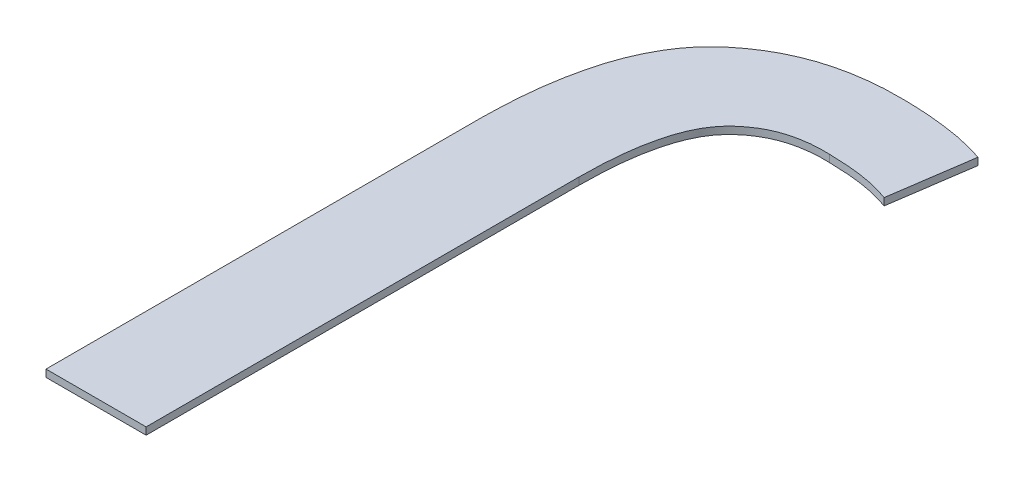
ISO-10303-21;
HEADER;
FILE_DESCRIPTION(('STEP AP214'),'2;1');
FILE_NAME('part.step','',(''),(''),'','','');
FILE_SCHEMA(('AUTOMOTIVE_DESIGN { 1 0 10303 214 1 1 1 1 }'));
ENDSEC;
DATA;
#1=APPLICATION_CONTEXT('core data for automotive mechanical design processes');
#2=APPLICATION_PROTOCOL_DEFINITION('international standard','automotive_design',2000,#1);
#3=PRODUCT_CONTEXT('',#1,'mechanical');
#4=PRODUCT('Part','Part','',(#3));
#5=PRODUCT_RELATED_PRODUCT_CATEGORY('part','',(#4));
#6=PRODUCT_DEFINITION_FORMATION('','',#4);
#7=PRODUCT_DEFINITION_CONTEXT('part definition',#1,'design');
#8=PRODUCT_DEFINITION('design','',#6,#7);
#9=PRODUCT_DEFINITION_SHAPE('','',#8);
#10=(LENGTH_UNIT() NAMED_UNIT(*) SI_UNIT(.MILLI.,.METRE.));
#11=(NAMED_UNIT(*) PLANE_ANGLE_UNIT() SI_UNIT($,.RADIAN.));
#12=(NAMED_UNIT(*) SI_UNIT($,.STERADIAN.) SOLID_ANGLE_UNIT());
#13=UNCERTAINTY_MEASURE_WITH_UNIT(LENGTH_MEASURE(1.E-05),#10,'distance_accuracy_value','');
#14=(GEOMETRIC_REPRESENTATION_CONTEXT(3) GLOBAL_UNCERTAINTY_ASSIGNED_CONTEXT((#13)) GLOBAL_UNIT_ASSIGNED_CONTEXT((#10,
#11,#12)) REPRESENTATION_CONTEXT('',''));
#15=CARTESIAN_POINT('',(0.,0.,0.));
#16=DIRECTION('',(0.,0.,1.));
#17=DIRECTION('',(1.,0.,0.));
#18=AXIS2_PLACEMENT_3D('',#15,#16,#17);
#19=CARTESIAN_POINT('',(-0.552273294096341,0.006,-0.15386547758367));
#20=DIRECTION('',(1.,0.,0.));
#21=DIRECTION('',(0.,0.,-1.));
#22=AXIS2_PLACEMENT_3D('',#19,#20,#21);
#23=PLANE('',#22);
#24=DIRECTION('',(0.,0.,1.));
#25=VECTOR('',#24,1.);
#26=CARTESIAN_POINT('',(-0.552273294096341,0.,-0.15386547758367));
#27=LINE('',#26,#25);
#28=CARTESIAN_POINT('',(-0.552273294096341,0.,-0.153865477583671));
#29=VERTEX_POINT('',#28);
#30=CARTESIAN_POINT('',(-0.552273294096341,0.,0.207212096222748));
#31=VERTEX_POINT('',#30);
#32=EDGE_CURVE('E210',#29,#31,#27,.T.);
#33=ORIENTED_EDGE('',*,*,#32,.T.);
#34=DIRECTION('',(0.,-1.,0.));
#35=VECTOR('',#34,1.);
#36=CARTESIAN_POINT('',(-0.552273294096341,0.006,0.207212096222748));
#37=LINE('',#36,#35);
#38=CARTESIAN_POINT('',(-0.552273294096341,0.006,0.207212096222748));
#39=VERTEX_POINT('',#38);
#40=EDGE_CURVE('E11',#39,#31,#37,.T.);
#41=ORIENTED_EDGE('',*,*,#40,.F.);
#42=DIRECTION('',(0.,0.,1.));
#43=VECTOR('',#42,1.);
#44=CARTESIAN_POINT('',(-0.552273294096341,0.006,-0.15386547758367));
#45=LINE('',#44,#43);
#46=CARTESIAN_POINT('',(-0.552273294096341,0.006,-0.153865477583671));
#47=VERTEX_POINT('',#46);
#48=EDGE_CURVE('E171',#47,#39,#45,.T.);
#49=ORIENTED_EDGE('',*,*,#48,.F.);
#50=DIRECTION('',(0.,-1.,0.));
#51=VECTOR('',#50,1.);
#52=CARTESIAN_POINT('',(-0.552273294096341,0.006,-0.153865477583671));
#53=LINE('',#52,#51);
#54=EDGE_CURVE('E126',#47,#29,#53,.T.);
#55=ORIENTED_EDGE('',*,*,#54,.T.);
#56=EDGE_LOOP('',(#33,#41,#49,#55));
#57=FACE_BOUND('',#56,.T.);
#58=ADVANCED_FACE('F34',(#57),#23,.F.);
#59=CARTESIAN_POINT('',(-0.552273294096341,0.006,0.207212096222748));
#60=DIRECTION('',(0.,0.,-1.));
#61=DIRECTION('',(-1.,0.,0.));
#62=AXIS2_PLACEMENT_3D('',#59,#60,#61);
#63=PLANE('',#62);
#64=DIRECTION('',(1.,0.,0.));
#65=VECTOR('',#64,1.);
#66=CARTESIAN_POINT('',(-0.552273294096341,0.,0.207212096222748));
#67=LINE('',#66,#65);
#68=CARTESIAN_POINT('',(-0.469416036299848,0.,0.207212096222748));
#69=VERTEX_POINT('',#68);
#70=EDGE_CURVE('E204',#31,#69,#67,.T.);
#71=ORIENTED_EDGE('',*,*,#70,.T.);
#72=DIRECTION('',(0.,-1.,0.));
#73=VECTOR('',#72,1.);
#74=CARTESIAN_POINT('',(-0.469416036299848,0.006,0.207212096222748));
#75=LINE('',#74,#73);
#76=CARTESIAN_POINT('',(-0.469416036299848,0.006,0.207212096222748));
#77=VERTEX_POINT('',#76);
#78=EDGE_CURVE('E42',#77,#69,#75,.T.);
#79=ORIENTED_EDGE('',*,*,#78,.F.);
#80=DIRECTION('',(1.,0.,0.));
#81=VECTOR('',#80,1.);
#82=CARTESIAN_POINT('',(-0.552273294096341,0.006,0.207212096222748));
#83=LINE('',#82,#81);
#84=EDGE_CURVE('E93',#39,#77,#83,.T.);
#85=ORIENTED_EDGE('',*,*,#84,.F.);
#86=ORIENTED_EDGE('',*,*,#40,.T.);
#87=EDGE_LOOP('',(#71,#79,#85,#86));
#88=FACE_BOUND('',#87,.T.);
#89=ADVANCED_FACE('F232',(#88),#63,.F.);
#90=CARTESIAN_POINT('',(-0.469416036299848,0.006,0.207212096222748));
#91=DIRECTION('',(-1.,0.,0.));
#92=DIRECTION('',(0.,0.,1.));
#93=AXIS2_PLACEMENT_3D('',#90,#91,#92);
#94=PLANE('',#93);
#95=DIRECTION('',(0.,0.,-1.));
#96=VECTOR('',#95,1.);
#97=CARTESIAN_POINT('',(-0.469416036299848,0.,0.207212096222748));
#98=LINE('',#97,#96);
#99=CARTESIAN_POINT('',(-0.469416036299848,0.,-0.151089149743533));
#100=VERTEX_POINT('',#99);
#101=EDGE_CURVE('E199',#69,#100,#98,.T.);
#102=ORIENTED_EDGE('',*,*,#101,.T.);
#103=DIRECTION('',(0.,-1.,0.));
#104=VECTOR('',#103,1.);
#105=CARTESIAN_POINT('',(-0.469416036299848,0.006,-0.151089149743533));
#106=LINE('',#105,#104);
#107=CARTESIAN_POINT('',(-0.469416036299848,0.006,-0.151089149743533));
#108=VERTEX_POINT('',#107);
#109=EDGE_CURVE('E191',#108,#100,#106,.T.);
#110=ORIENTED_EDGE('',*,*,#109,.F.);
#111=DIRECTION('',(0.,0.,-1.));
#112=VECTOR('',#111,1.);
#113=CARTESIAN_POINT('',(-0.469416036299848,0.006,0.207212096222748));
#114=LINE('',#113,#112);
#115=EDGE_CURVE('E165',#77,#108,#114,.T.);
#116=ORIENTED_EDGE('',*,*,#115,.F.);
#117=ORIENTED_EDGE('',*,*,#78,.T.);
#118=EDGE_LOOP('',(#102,#110,#116,#117));
#119=FACE_BOUND('',#118,.T.);
#120=ADVANCED_FACE('F197',(#119),#94,.F.);
#121=CARTESIAN_POINT('',(-0.469416036299848,0.006,-0.151089149743533));
#122=CARTESIAN_POINT('',(-0.469337668432445,0.006,-0.156710764659553));
#123=CARTESIAN_POINT('',(-0.469187030640725,0.006,-0.167516566640904));
#124=CARTESIAN_POINT('',(-0.468051362626175,0.006,-0.183019987168691));
#125=CARTESIAN_POINT('',(-0.46630936957585,0.006,-0.197186891604784));
#126=CARTESIAN_POINT('',(-0.46360819117192,0.006,-0.209875156332515));
#127=CARTESIAN_POINT('',(-0.460547741454844,0.006,-0.221272507539462));
#128=CARTESIAN_POINT('',(-0.456571693490011,0.006,-0.231201279501752));
#129=CARTESIAN_POINT('',(-0.4519142955133,0.006,-0.239795102661912));
#130=CARTESIAN_POINT('',(-0.446397888397714,0.006,-0.246954711664905));
#131=CARTESIAN_POINT('',(-0.440258106819841,0.006,-0.252955311430089));
#132=CARTESIAN_POINT('',(-0.433597543655136,0.006,-0.258071325340383));
#133=CARTESIAN_POINT('',(-0.42638388990424,0.006,-0.26240557805737));
#134=CARTESIAN_POINT('',(-0.418587315050106,0.006,-0.265910912685989));
#135=CARTESIAN_POINT('',(-0.410168879270515,0.006,-0.268420499203571));
#136=CARTESIAN_POINT('',(-0.401249065221441,0.006,-0.270140745251749));
#137=CARTESIAN_POINT('',(-0.391783880229694,0.006,-0.271114739904381));
#138=CARTESIAN_POINT('',(-0.385302472670253,0.006,-0.270977129714614));
#139=CARTESIAN_POINT('',(-0.381967140219809,0.006,-0.270906315508405));
#140=B_SPLINE_CURVE_WITH_KNOTS('',3,(#121,#122,#123,#124,#125,#126,#127,#128,#129,#130,#131,
#132,#133,#134,#135,#136,#137,#138,#139),.UNSPECIFIED.,.F.,.F.,(4,1,1,1,1,1,1,1,1,1,1,1,1,1,1,1,
4),(0.,0.0983860291996174,0.189116466557098,0.27197123945058,0.347983258187652,
0.416023109793835,0.478265351250489,0.534761260369765,0.586560463987548,0.635816773464451,
0.684639416603328,0.733240129219385,0.782808474359632,0.833845959526921,0.886621313547149,
0.941655325846,1.),.UNSPECIFIED.);
#141=DIRECTION('',(0.,-1.,0.));
#142=VECTOR('',#141,1.);
#143=SURFACE_OF_LINEAR_EXTRUSION('',#140,#142);
#144=CARTESIAN_POINT('',(-0.469416036299848,0.,-0.151089149743533));
#145=CARTESIAN_POINT('',(-0.469337668432445,0.,-0.156710764659553));
#146=CARTESIAN_POINT('',(-0.469187030640725,0.,-0.167516566640904));
#147=CARTESIAN_POINT('',(-0.468051362626175,0.,-0.183019987168691));
#148=CARTESIAN_POINT('',(-0.46630936957585,0.,-0.197186891604784));
#149=CARTESIAN_POINT('',(-0.46360819117192,0.,-0.209875156332515));
#150=CARTESIAN_POINT('',(-0.460547741454844,0.,-0.221272507539462));
#151=CARTESIAN_POINT('',(-0.456571693490011,0.,-0.231201279501752));
#152=CARTESIAN_POINT('',(-0.4519142955133,0.,-0.239795102661912));
#153=CARTESIAN_POINT('',(-0.446397888397714,0.,-0.246954711664905));
#154=CARTESIAN_POINT('',(-0.440258106819841,0.,-0.252955311430089));
#155=CARTESIAN_POINT('',(-0.433597543655136,0.,-0.258071325340383));
#156=CARTESIAN_POINT('',(-0.42638388990424,0.,-0.26240557805737));
#157=CARTESIAN_POINT('',(-0.418587315050106,0.,-0.265910912685989));
#158=CARTESIAN_POINT('',(-0.410168879270515,0.,-0.268420499203571));
#159=CARTESIAN_POINT('',(-0.401249065221441,0.,-0.270140745251749));
#160=CARTESIAN_POINT('',(-0.391783880229694,0.,-0.271114739904381));
#161=CARTESIAN_POINT('',(-0.385302472670253,0.,-0.270977129714614));
#162=CARTESIAN_POINT('',(-0.381967140219809,0.,-0.270906315508405));
#163=B_SPLINE_CURVE_WITH_KNOTS('',3,(#144,#145,#146,#147,#148,#149,#150,#151,#152,#153,#154,
#155,#156,#157,#158,#159,#160,#161,#162),.UNSPECIFIED.,.F.,.F.,(4,1,1,1,1,1,1,1,1,1,1,1,1,1,1,1,
4),(0.,0.0983860291996174,0.189116466557098,0.27197123945058,0.347983258187652,
0.416023109793835,0.478265351250489,0.534761260369765,0.586560463987548,0.635816773464451,
0.684639416603328,0.733240129219385,0.782808474359632,0.833845959526921,0.886621313547149,
0.941655325846,1.),.UNSPECIFIED.);
#164=CARTESIAN_POINT('',(-0.381967140219809,0.,-0.270906315508405));
#165=VERTEX_POINT('',#164);
#166=EDGE_CURVE('E206',#100,#165,#163,.T.);
#167=ORIENTED_EDGE('',*,*,#166,.T.);
#168=DIRECTION('',(0.,-1.,0.));
#169=VECTOR('',#168,1.);
#170=CARTESIAN_POINT('',(-0.381967140219809,0.006,-0.270906315508405));
#171=LINE('',#170,#169);
#172=CARTESIAN_POINT('',(-0.381967140219809,0.006,-0.270906315508405));
#173=VERTEX_POINT('',#172);
#174=EDGE_CURVE('E188',#173,#165,#171,.T.);
#175=ORIENTED_EDGE('',*,*,#174,.F.);
#176=EDGE_CURVE('E157',#108,#173,#140,.T.);
#177=ORIENTED_EDGE('',*,*,#176,.F.);
#178=ORIENTED_EDGE('',*,*,#109,.T.);
#179=EDGE_LOOP('',(#167,#175,#177,#178));
#180=FACE_BOUND('',#179,.T.);
#181=ADVANCED_FACE('F150',(#180),#143,.F.);
#182=CARTESIAN_POINT('',(-0.381967140219809,0.006,-0.270906315508405));
#183=CARTESIAN_POINT('',(-0.376724266556487,0.006,-0.270742629079489));
#184=CARTESIAN_POINT('',(-0.366722854761358,0.006,-0.270430377538448));
#185=CARTESIAN_POINT('',(-0.352487182291243,0.006,-0.268821302449865));
#186=CARTESIAN_POINT('',(-0.339787948115716,0.006,-0.266275373822243));
#187=CARTESIAN_POINT('',(-0.332048262192236,0.006,-0.26366760199365));
#188=CARTESIAN_POINT('',(-0.328395701762542,0.006,-0.262436926190399));
#189=B_SPLINE_CURVE_WITH_KNOTS('',3,(#182,#183,#184,#185,#186,#187,#188),.UNSPECIFIED.,.F.,.F.,
(4,1,1,1,4),(0.,0.288687948249944,0.550706966474674,0.787966853976176,1.),.UNSPECIFIED.);
#190=DIRECTION('',(0.,-1.,0.));
#191=VECTOR('',#190,1.);
#192=SURFACE_OF_LINEAR_EXTRUSION('',#189,#191);
#193=CARTESIAN_POINT('',(-0.381967140219809,0.,-0.270906315508405));
#194=CARTESIAN_POINT('',(-0.376724266556487,0.,-0.270742629079489));
#195=CARTESIAN_POINT('',(-0.366722854761358,0.,-0.270430377538448));
#196=CARTESIAN_POINT('',(-0.352487182291243,0.,-0.268821302449865));
#197=CARTESIAN_POINT('',(-0.339787948115716,0.,-0.266275373822243));
#198=CARTESIAN_POINT('',(-0.332048262192236,0.,-0.26366760199365));
#199=CARTESIAN_POINT('',(-0.328395701762542,0.,-0.262436926190399));
#200=B_SPLINE_CURVE_WITH_KNOTS('',3,(#193,#194,#195,#196,#197,#198,#199),.UNSPECIFIED.,.F.,.F.,
(4,1,1,1,4),(0.,0.288687948249944,0.550706966474674,0.787966853976176,1.),.UNSPECIFIED.);
#201=CARTESIAN_POINT('',(-0.328395701762542,0.,-0.262436926190399));
#202=VERTEX_POINT('',#201);
#203=EDGE_CURVE('E208',#165,#202,#200,.T.);
#204=ORIENTED_EDGE('',*,*,#203,.T.);
#205=DIRECTION('',(0.,-1.,0.));
#206=VECTOR('',#205,1.);
#207=CARTESIAN_POINT('',(-0.328395701762542,0.006,-0.262436926190399));
#208=LINE('',#207,#206);
#209=CARTESIAN_POINT('',(-0.328395701762542,0.006,-0.262436926190399));
#210=VERTEX_POINT('',#209);
#211=EDGE_CURVE('E121',#210,#202,#208,.T.);
#212=ORIENTED_EDGE('',*,*,#211,.F.);
#213=EDGE_CURVE('E112',#173,#210,#189,.T.);
#214=ORIENTED_EDGE('',*,*,#213,.F.);
#215=ORIENTED_EDGE('',*,*,#174,.T.);
#216=EDGE_LOOP('',(#204,#212,#214,#215));
#217=FACE_BOUND('',#216,.T.);
#218=ADVANCED_FACE('F147',(#217),#192,.F.);
#219=CARTESIAN_POINT('',(-0.328395701762542,0.006,-0.262436926190399));
#220=DIRECTION('',(-0.989471047348127,0.,-0.144730945066353));
#221=DIRECTION('',(-0.144730945066353,0.,0.989471047348128));
#222=AXIS2_PLACEMENT_3D('',#219,#220,#221);
#223=PLANE('',#222);
#224=DIRECTION('',(0.144730945066353,0.,-0.989471047348127));
#225=VECTOR('',#224,1.);
#226=CARTESIAN_POINT('',(-0.328395701762542,0.,-0.262436926190399));
#227=LINE('',#226,#225);
#228=CARTESIAN_POINT('',(-0.318478109849485,0.,-0.330239772726674));
#229=VERTEX_POINT('',#228);
#230=EDGE_CURVE('E120',#202,#229,#227,.T.);
#231=ORIENTED_EDGE('',*,*,#230,.T.);
#232=DIRECTION('',(0.,-1.,0.));
#233=VECTOR('',#232,1.);
#234=CARTESIAN_POINT('',(-0.318478109849485,0.006,-0.330239772726674));
#235=LINE('',#234,#233);
#236=CARTESIAN_POINT('',(-0.318478109849485,0.006,-0.330239772726674));
#237=VERTEX_POINT('',#236);
#238=EDGE_CURVE('E117',#237,#229,#235,.T.);
#239=ORIENTED_EDGE('',*,*,#238,.F.);
#240=DIRECTION('',(0.144730945066353,0.,-0.989471047348127));
#241=VECTOR('',#240,1.);
#242=CARTESIAN_POINT('',(-0.328395701762542,0.006,-0.262436926190399));
#243=LINE('',#242,#241);
#244=EDGE_CURVE('E106',#210,#237,#243,.T.);
#245=ORIENTED_EDGE('',*,*,#244,.F.);
#246=ORIENTED_EDGE('',*,*,#211,.T.);
#247=EDGE_LOOP('',(#231,#239,#245,#246));
#248=FACE_BOUND('',#247,.T.);
#249=ADVANCED_FACE('F118',(#248),#223,.F.);
#250=CARTESIAN_POINT('',(-0.318478109849485,0.006,-0.330239772726674));
#251=CARTESIAN_POINT('',(-0.320825797884387,0.006,-0.330991558053056));
#252=CARTESIAN_POINT('',(-0.325688200483862,0.006,-0.332548614557542));
#253=CARTESIAN_POINT('',(-0.333418865952208,0.006,-0.334595902767406));
#254=CARTESIAN_POINT('',(-0.341857287550663,0.006,-0.336433720997437));
#255=CARTESIAN_POINT('',(-0.354125933330945,0.006,-0.338423269029014));
#256=CARTESIAN_POINT('',(-0.369943111911709,0.006,-0.340262821939287));
#257=CARTESIAN_POINT('',(-0.38274369146314,0.006,-0.340624439046402));
#258=CARTESIAN_POINT('',(-0.389109998680778,0.006,-0.340804287590744));
#259=B_SPLINE_CURVE_WITH_KNOTS('',3,(#250,#251,#252,#253,#254,#255,#256,#257,#258),
.UNSPECIFIED.,.F.,.F.,(4,1,1,1,1,1,4),(0.,0.103139195979262,0.213616241673338,0.334495418146242,
0.464358482783334,0.733601244895057,1.),.UNSPECIFIED.);
#260=DIRECTION('',(0.,-1.,0.));
#261=VECTOR('',#260,1.);
#262=SURFACE_OF_LINEAR_EXTRUSION('',#259,#261);
#263=CARTESIAN_POINT('',(-0.318478109849485,0.,-0.330239772726674));
#264=CARTESIAN_POINT('',(-0.320825797884387,0.,-0.330991558053056));
#265=CARTESIAN_POINT('',(-0.325688200483862,0.,-0.332548614557542));
#266=CARTESIAN_POINT('',(-0.333418865952208,0.,-0.334595902767406));
#267=CARTESIAN_POINT('',(-0.341857287550663,0.,-0.336433720997437));
#268=CARTESIAN_POINT('',(-0.354125933330945,0.,-0.338423269029014));
#269=CARTESIAN_POINT('',(-0.369943111911709,0.,-0.340262821939287));
#270=CARTESIAN_POINT('',(-0.38274369146314,0.,-0.340624439046402));
#271=CARTESIAN_POINT('',(-0.389109998680778,0.,-0.340804287590744));
#272=B_SPLINE_CURVE_WITH_KNOTS('',3,(#263,#264,#265,#266,#267,#268,#269,#270,#271),
.UNSPECIFIED.,.F.,.F.,(4,1,1,1,1,1,4),(0.,0.103139195979262,0.213616241673338,0.334495418146242,
0.464358482783334,0.733601244895057,1.),.UNSPECIFIED.);
#273=CARTESIAN_POINT('',(-0.389109998680778,0.,-0.340804287590744));
#274=VERTEX_POINT('',#273);
#275=EDGE_CURVE('E79',#229,#274,#272,.T.);
#276=ORIENTED_EDGE('',*,*,#275,.T.);
#277=DIRECTION('',(0.,-1.,0.));
#278=VECTOR('',#277,1.);
#279=CARTESIAN_POINT('',(-0.389109998680778,0.006,-0.340804287590744));
#280=LINE('',#279,#278);
#281=CARTESIAN_POINT('',(-0.389109998680778,0.006,-0.340804287590744));
#282=VERTEX_POINT('',#281);
#283=EDGE_CURVE('E122',#282,#274,#280,.T.);
#284=ORIENTED_EDGE('',*,*,#283,.F.);
#285=EDGE_CURVE('E110',#237,#282,#259,.T.);
#286=ORIENTED_EDGE('',*,*,#285,.F.);
#287=ORIENTED_EDGE('',*,*,#238,.T.);
#288=EDGE_LOOP('',(#276,#284,#286,#287));
#289=FACE_BOUND('',#288,.T.);
#290=ADVANCED_FACE('F124',(#289),#262,.F.);
#291=CARTESIAN_POINT('',(-0.389109998680778,0.006,-0.340804287590744));
#292=CARTESIAN_POINT('',(-0.394998076323733,0.006,-0.340800326383935));
#293=CARTESIAN_POINT('',(-0.406527443658516,0.006,-0.340792569997019));
#294=CARTESIAN_POINT('',(-0.423393566893323,0.006,-0.339124687404527));
#295=CARTESIAN_POINT('',(-0.43938217317099,0.006,-0.336197942765887));
#296=CARTESIAN_POINT('',(-0.454537126096337,0.006,-0.331897822308368));
#297=CARTESIAN_POINT('',(-0.468829459160651,0.006,-0.326183975734152));
#298=CARTESIAN_POINT('',(-0.48228070681272,0.006,-0.319119390888364));
#299=CARTESIAN_POINT('',(-0.494833002950038,0.006,-0.310665770587417));
#300=CARTESIAN_POINT('',(-0.506548755343645,0.006,-0.300866425969522));
#301=CARTESIAN_POINT('',(-0.517226948099312,0.006,-0.289369479740931));
#302=CARTESIAN_POINT('',(-0.526323340790358,0.006,-0.275743230205105));
#303=CARTESIAN_POINT('',(-0.534189516942013,0.006,-0.260273243559812));
#304=CARTESIAN_POINT('',(-0.540589361042648,0.006,-0.242792297744767));
#305=CARTESIAN_POINT('',(-0.545497562678394,0.006,-0.22335122232389));
#306=CARTESIAN_POINT('',(-0.549276642331266,0.006,-0.201976127510736));
#307=CARTESIAN_POINT('',(-0.551575084046056,0.006,-0.178573098217121));
#308=CARTESIAN_POINT('',(-0.552034775664599,0.006,-0.162305950365689));
#309=CARTESIAN_POINT('',(-0.552273294096341,0.006,-0.153865477583671));
#310=B_SPLINE_CURVE_WITH_KNOTS('',3,(#291,#292,#293,#294,#295,#296,#297,#298,#299,#300,#301,
#302,#303,#304,#305,#306,#307,#308,#309),.UNSPECIFIED.,.F.,.F.,(4,1,1,1,1,1,1,1,1,1,1,1,1,1,1,1,
4),(0.,0.0619628053186958,0.121328553550531,0.178151227892696,0.23290031844117,
0.286898198533316,0.339920645521068,0.392561989110601,0.445933993400267,0.500424809931023,
0.557140178877669,0.617840011406211,0.682765156006183,0.752686137890521,0.828695498194016,
0.911115888406743,1.),.UNSPECIFIED.);
#311=DIRECTION('',(0.,-1.,0.));
#312=VECTOR('',#311,1.);
#313=SURFACE_OF_LINEAR_EXTRUSION('',#310,#312);
#314=CARTESIAN_POINT('',(-0.389109998680778,0.,-0.340804287590744));
#315=CARTESIAN_POINT('',(-0.394998076323733,0.,-0.340800326383935));
#316=CARTESIAN_POINT('',(-0.406527443658516,0.,-0.340792569997019));
#317=CARTESIAN_POINT('',(-0.423393566893323,0.,-0.339124687404527));
#318=CARTESIAN_POINT('',(-0.43938217317099,0.,-0.336197942765887));
#319=CARTESIAN_POINT('',(-0.454537126096337,0.,-0.331897822308368));
#320=CARTESIAN_POINT('',(-0.468829459160651,0.,-0.326183975734152));
#321=CARTESIAN_POINT('',(-0.48228070681272,0.,-0.319119390888364));
#322=CARTESIAN_POINT('',(-0.494833002950038,0.,-0.310665770587417));
#323=CARTESIAN_POINT('',(-0.506548755343645,0.,-0.300866425969522));
#324=CARTESIAN_POINT('',(-0.517226948099312,0.,-0.289369479740931));
#325=CARTESIAN_POINT('',(-0.526323340790358,0.,-0.275743230205105));
#326=CARTESIAN_POINT('',(-0.534189516942013,0.,-0.260273243559812));
#327=CARTESIAN_POINT('',(-0.540589361042648,0.,-0.242792297744767));
#328=CARTESIAN_POINT('',(-0.545497562678394,0.,-0.22335122232389));
#329=CARTESIAN_POINT('',(-0.549276642331266,0.,-0.201976127510736));
#330=CARTESIAN_POINT('',(-0.551575084046056,0.,-0.178573098217121));
#331=CARTESIAN_POINT('',(-0.552034775664599,0.,-0.162305950365689));
#332=CARTESIAN_POINT('',(-0.552273294096341,0.,-0.153865477583671));
#333=B_SPLINE_CURVE_WITH_KNOTS('',3,(#314,#315,#316,#317,#318,#319,#320,#321,#322,#323,#324,
#325,#326,#327,#328,#329,#330,#331,#332),.UNSPECIFIED.,.F.,.F.,(4,1,1,1,1,1,1,1,1,1,1,1,1,1,1,1,
4),(0.,0.0619628053186958,0.121328553550531,0.178151227892696,0.23290031844117,
0.286898198533316,0.339920645521068,0.392561989110601,0.445933993400267,0.500424809931023,
0.557140178877669,0.617840011406211,0.682765156006183,0.752686137890521,0.828695498194016,
0.911115888406743,1.),.UNSPECIFIED.);
#334=EDGE_CURVE('E85',#274,#29,#333,.T.);
#335=ORIENTED_EDGE('',*,*,#334,.T.);
#336=ORIENTED_EDGE('',*,*,#54,.F.);
#337=EDGE_CURVE('E50',#282,#47,#310,.T.);
#338=ORIENTED_EDGE('',*,*,#337,.F.);
#339=ORIENTED_EDGE('',*,*,#283,.T.);
#340=EDGE_LOOP('',(#335,#336,#338,#339));
#341=FACE_BOUND('',#340,.T.);
#342=ADVANCED_FACE('F143',(#341),#313,.F.);
#343=CARTESIAN_POINT('',(-0.454583394228794,0.006,-0.234751026923618));
#344=DIRECTION('',(0.,1.,0.));
#345=DIRECTION('',(0.,0.,1.));
#346=AXIS2_PLACEMENT_3D('',#343,#344,#345);
#347=PLANE('',#346);
#348=ORIENTED_EDGE('',*,*,#48,.T.);
#349=ORIENTED_EDGE('',*,*,#84,.T.);
#350=ORIENTED_EDGE('',*,*,#115,.T.);
#351=ORIENTED_EDGE('',*,*,#176,.T.);
#352=ORIENTED_EDGE('',*,*,#213,.T.);
#353=ORIENTED_EDGE('',*,*,#244,.T.);
#354=ORIENTED_EDGE('',*,*,#285,.T.);
#355=ORIENTED_EDGE('',*,*,#337,.T.);
#356=EDGE_LOOP('',(#348,#349,#350,#351,#352,#353,#354,#355));
#357=FACE_BOUND('',#356,.T.);
#358=ADVANCED_FACE('F108',(#357),#347,.T.);
#359=CARTESIAN_POINT('',(-0.454583394228794,0.,-0.234751026923618));
#360=DIRECTION('',(0.,1.,0.));
#361=DIRECTION('',(0.,0.,1.));
#362=AXIS2_PLACEMENT_3D('',#359,#360,#361);
#363=PLANE('',#362);
#364=ORIENTED_EDGE('',*,*,#32,.F.);
#365=ORIENTED_EDGE('',*,*,#334,.F.);
#366=ORIENTED_EDGE('',*,*,#275,.F.);
#367=ORIENTED_EDGE('',*,*,#230,.F.);
#368=ORIENTED_EDGE('',*,*,#203,.F.);
#369=ORIENTED_EDGE('',*,*,#166,.F.);
#370=ORIENTED_EDGE('',*,*,#101,.F.);
#371=ORIENTED_EDGE('',*,*,#70,.F.);
#372=EDGE_LOOP('',(#364,#365,#366,#367,#368,#369,#370,#371));
#373=FACE_BOUND('',#372,.T.);
#374=ADVANCED_FACE('F203',(#373),#363,.F.);
#375=CLOSED_SHELL('',(#58,#89,#120,#181,#218,#249,#290,#342,#358,#374));
#376=MANIFOLD_SOLID_BREP('B2',#375);
#377=ADVANCED_BREP_SHAPE_REPRESENTATION('',(#18,#376),#14);
#378=SHAPE_DEFINITION_REPRESENTATION(#9,#377);
ENDSEC;
END-ISO-10303-21;
